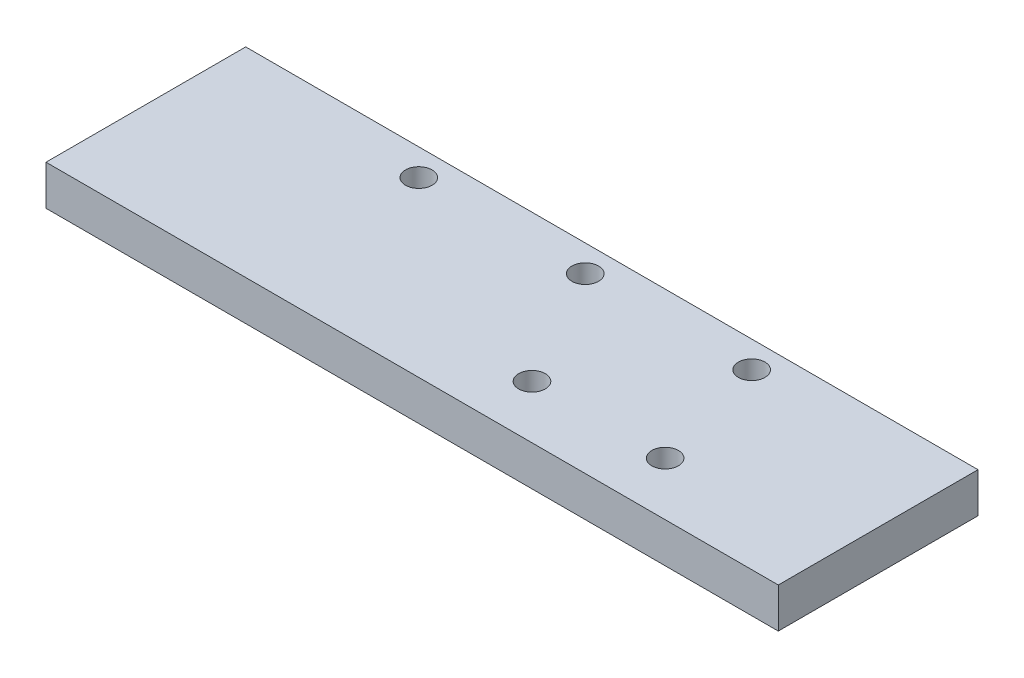
ISO-10303-21;
HEADER;
FILE_DESCRIPTION(('STEP AP214'),'2;1');
FILE_NAME('part.step','',(''),(''),'','','');
FILE_SCHEMA(('AUTOMOTIVE_DESIGN { 1 0 10303 214 1 1 1 1 }'));
ENDSEC;
DATA;
#1=APPLICATION_CONTEXT('core data for automotive mechanical design processes');
#2=APPLICATION_PROTOCOL_DEFINITION('international standard','automotive_design',2000,#1);
#3=PRODUCT_CONTEXT('',#1,'mechanical');
#4=PRODUCT('Part','Part','',(#3));
#5=PRODUCT_RELATED_PRODUCT_CATEGORY('part','',(#4));
#6=PRODUCT_DEFINITION_FORMATION('','',#4);
#7=PRODUCT_DEFINITION_CONTEXT('part definition',#1,'design');
#8=PRODUCT_DEFINITION('design','',#6,#7);
#9=PRODUCT_DEFINITION_SHAPE('','',#8);
#10=(LENGTH_UNIT() NAMED_UNIT(*) SI_UNIT(.MILLI.,.METRE.));
#11=(NAMED_UNIT(*) PLANE_ANGLE_UNIT() SI_UNIT($,.RADIAN.));
#12=(NAMED_UNIT(*) SI_UNIT($,.STERADIAN.) SOLID_ANGLE_UNIT());
#13=UNCERTAINTY_MEASURE_WITH_UNIT(LENGTH_MEASURE(1.E-05),#10,'distance_accuracy_value','');
#14=(GEOMETRIC_REPRESENTATION_CONTEXT(3) GLOBAL_UNCERTAINTY_ASSIGNED_CONTEXT((#13)) GLOBAL_UNIT_ASSIGNED_CONTEXT((#10,
#11,#12)) REPRESENTATION_CONTEXT('',''));
#15=CARTESIAN_POINT('',(0.,0.,0.));
#16=DIRECTION('',(0.,0.,1.));
#17=DIRECTION('',(1.,0.,0.));
#18=AXIS2_PLACEMENT_3D('',#15,#16,#17);
#19=CARTESIAN_POINT('',(-102.510460251046,6.,-65.1673640167364));
#20=DIRECTION('',(0.,0.,-1.));
#21=DIRECTION('',(-1.,0.,0.));
#22=AXIS2_PLACEMENT_3D('',#19,#20,#21);
#23=PLANE('',#22);
#24=DIRECTION('',(1.,0.,0.));
#25=VECTOR('',#24,1.);
#26=CARTESIAN_POINT('',(-102.510460251046,0.,-65.1673640167364));
#27=LINE('',#26,#25);
#28=CARTESIAN_POINT('',(-102.510460251046,0.,-65.1673640167364));
#29=VERTEX_POINT('',#28);
#30=CARTESIAN_POINT('',(7.48953974895393,0.,-65.1673640167364));
#31=VERTEX_POINT('',#30);
#32=EDGE_CURVE('E99',#29,#31,#27,.T.);
#33=ORIENTED_EDGE('',*,*,#32,.F.);
#34=DIRECTION('',(0.,-1.,0.));
#35=VECTOR('',#34,1.);
#36=CARTESIAN_POINT('',(-102.510460251046,6.,-65.1673640167364));
#37=LINE('',#36,#35);
#38=CARTESIAN_POINT('',(-102.510460251046,6.,-65.1673640167364));
#39=VERTEX_POINT('',#38);
#40=EDGE_CURVE('E11',#39,#29,#37,.T.);
#41=ORIENTED_EDGE('',*,*,#40,.F.);
#42=DIRECTION('',(1.,0.,0.));
#43=VECTOR('',#42,1.);
#44=CARTESIAN_POINT('',(-102.510460251046,6.,-65.1673640167364));
#45=LINE('',#44,#43);
#46=CARTESIAN_POINT('',(7.48953974895393,6.,-65.1673640167364));
#47=VERTEX_POINT('',#46);
#48=EDGE_CURVE('E93',#39,#47,#45,.T.);
#49=ORIENTED_EDGE('',*,*,#48,.T.);
#50=DIRECTION('',(0.,-1.,0.));
#51=VECTOR('',#50,1.);
#52=CARTESIAN_POINT('',(7.48953974895393,6.,-65.1673640167364));
#53=LINE('',#52,#51);
#54=EDGE_CURVE('E36',#47,#31,#53,.T.);
#55=ORIENTED_EDGE('',*,*,#54,.T.);
#56=EDGE_LOOP('',(#33,#41,#49,#55));
#57=FACE_BOUND('',#56,.T.);
#58=ADVANCED_FACE('F33',(#57),#23,.T.);
#59=CARTESIAN_POINT('',(-102.510460251046,6.,-65.1673640167364));
#60=DIRECTION('',(1.,0.,0.));
#61=DIRECTION('',(0.,0.,-1.));
#62=AXIS2_PLACEMENT_3D('',#59,#60,#61);
#63=PLANE('',#62);
#64=DIRECTION('',(0.,0.,1.));
#65=VECTOR('',#64,1.);
#66=CARTESIAN_POINT('',(-102.510460251046,0.,-65.1673640167364));
#67=LINE('',#66,#65);
#68=CARTESIAN_POINT('',(-102.510460251046,0.,-35.1673640167364));
#69=VERTEX_POINT('',#68);
#70=EDGE_CURVE('E66',#29,#69,#67,.T.);
#71=ORIENTED_EDGE('',*,*,#70,.T.);
#72=DIRECTION('',(0.,-1.,0.));
#73=VECTOR('',#72,1.);
#74=CARTESIAN_POINT('',(-102.510460251046,6.,-35.1673640167364));
#75=LINE('',#74,#73);
#76=CARTESIAN_POINT('',(-102.510460251046,6.,-35.1673640167364));
#77=VERTEX_POINT('',#76);
#78=EDGE_CURVE('E42',#77,#69,#75,.T.);
#79=ORIENTED_EDGE('',*,*,#78,.F.);
#80=DIRECTION('',(0.,0.,1.));
#81=VECTOR('',#80,1.);
#82=CARTESIAN_POINT('',(-102.510460251046,6.,-65.1673640167364));
#83=LINE('',#82,#81);
#84=EDGE_CURVE('E83',#39,#77,#83,.T.);
#85=ORIENTED_EDGE('',*,*,#84,.F.);
#86=ORIENTED_EDGE('',*,*,#40,.T.);
#87=EDGE_LOOP('',(#71,#79,#85,#86));
#88=FACE_BOUND('',#87,.T.);
#89=ADVANCED_FACE('F110',(#88),#63,.F.);
#90=CARTESIAN_POINT('',(-102.510460251046,6.,-35.1673640167364));
#91=DIRECTION('',(0.,0.,-1.));
#92=DIRECTION('',(-1.,0.,0.));
#93=AXIS2_PLACEMENT_3D('',#90,#91,#92);
#94=PLANE('',#93);
#95=DIRECTION('',(1.,0.,0.));
#96=VECTOR('',#95,1.);
#97=CARTESIAN_POINT('',(-102.510460251046,0.,-35.1673640167364));
#98=LINE('',#97,#96);
#99=CARTESIAN_POINT('',(7.48953974895393,0.,-35.1673640167364));
#100=VERTEX_POINT('',#99);
#101=EDGE_CURVE('E90',#69,#100,#98,.T.);
#102=ORIENTED_EDGE('',*,*,#101,.T.);
#103=DIRECTION('',(0.,-1.,0.));
#104=VECTOR('',#103,1.);
#105=CARTESIAN_POINT('',(7.48953974895393,6.,-35.1673640167364));
#106=LINE('',#105,#104);
#107=CARTESIAN_POINT('',(7.48953974895393,6.,-35.1673640167364));
#108=VERTEX_POINT('',#107);
#109=EDGE_CURVE('E87',#108,#100,#106,.T.);
#110=ORIENTED_EDGE('',*,*,#109,.F.);
#111=DIRECTION('',(1.,0.,0.));
#112=VECTOR('',#111,1.);
#113=CARTESIAN_POINT('',(-102.510460251046,6.,-35.1673640167364));
#114=LINE('',#113,#112);
#115=EDGE_CURVE('E78',#77,#108,#114,.T.);
#116=ORIENTED_EDGE('',*,*,#115,.F.);
#117=ORIENTED_EDGE('',*,*,#78,.T.);
#118=EDGE_LOOP('',(#102,#110,#116,#117));
#119=FACE_BOUND('',#118,.T.);
#120=ADVANCED_FACE('F88',(#119),#94,.F.);
#121=CARTESIAN_POINT('',(7.48953974895393,6.,-65.1673640167364));
#122=DIRECTION('',(1.,0.,0.));
#123=DIRECTION('',(0.,0.,-1.));
#124=AXIS2_PLACEMENT_3D('',#121,#122,#123);
#125=PLANE('',#124);
#126=DIRECTION('',(0.,0.,1.));
#127=VECTOR('',#126,1.);
#128=CARTESIAN_POINT('',(7.48953974895393,0.,-65.1673640167364));
#129=LINE('',#128,#127);
#130=EDGE_CURVE('E102',#31,#100,#129,.T.);
#131=ORIENTED_EDGE('',*,*,#130,.F.);
#132=ORIENTED_EDGE('',*,*,#54,.F.);
#133=DIRECTION('',(0.,0.,1.));
#134=VECTOR('',#133,1.);
#135=CARTESIAN_POINT('',(7.48953974895393,6.,-65.1673640167364));
#136=LINE('',#135,#134);
#137=EDGE_CURVE('E82',#47,#108,#136,.T.);
#138=ORIENTED_EDGE('',*,*,#137,.T.);
#139=ORIENTED_EDGE('',*,*,#109,.T.);
#140=EDGE_LOOP('',(#131,#132,#138,#139));
#141=FACE_BOUND('',#140,.T.);
#142=ADVANCED_FACE('F92',(#141),#125,.T.);
#143=CARTESIAN_POINT('',(0.,6.,0.));
#144=DIRECTION('',(0.,-1.,0.));
#145=DIRECTION('',(0.,0.,-1.));
#146=AXIS2_PLACEMENT_3D('',#143,#144,#145);
#147=PLANE('',#146);
#148=CARTESIAN_POINT('',(-72.5104602510461,6.,-61.1673640167364));
#149=DIRECTION('',(0.,-1.,0.));
#150=DIRECTION('',(0.,0.,-1.));
#151=AXIS2_PLACEMENT_3D('',#148,#149,#150);
#152=CIRCLE('',#151,2.);
#153=CARTESIAN_POINT('',(-72.5104602510461,6.,-63.1673640167364));
#154=VERTEX_POINT('',#153);
#155=EDGE_CURVE('E103',#154,#154,#152,.T.);
#156=ORIENTED_EDGE('',*,*,#155,.T.);
#157=EDGE_LOOP('',(#156));
#158=FACE_BOUND('',#157,.T.);
#159=CARTESIAN_POINT('',(-47.5104602510461,6.,-61.1673640167364));
#160=DIRECTION('',(0.,-1.,0.));
#161=DIRECTION('',(0.,0.,-1.));
#162=AXIS2_PLACEMENT_3D('',#159,#160,#161);
#163=CIRCLE('',#162,2.);
#164=CARTESIAN_POINT('',(-47.5104602510461,6.,-63.1673640167364));
#165=VERTEX_POINT('',#164);
#166=EDGE_CURVE('E159',#165,#165,#163,.T.);
#167=ORIENTED_EDGE('',*,*,#166,.T.);
#168=EDGE_LOOP('',(#167));
#169=FACE_BOUND('',#168,.T.);
#170=CARTESIAN_POINT('',(-22.5104602510461,6.,-61.1673640167364));
#171=DIRECTION('',(0.,-1.,0.));
#172=DIRECTION('',(0.,0.,-1.));
#173=AXIS2_PLACEMENT_3D('',#170,#171,#172);
#174=CIRCLE('',#173,2.00000000000001);
#175=CARTESIAN_POINT('',(-22.5104602510461,6.,-63.1673640167364));
#176=VERTEX_POINT('',#175);
#177=EDGE_CURVE('E161',#176,#176,#174,.T.);
#178=ORIENTED_EDGE('',*,*,#177,.T.);
#179=EDGE_LOOP('',(#178));
#180=FACE_BOUND('',#179,.T.);
#181=CARTESIAN_POINT('',(-17.5104602510461,6.,-43.1673640167364));
#182=DIRECTION('',(0.,-1.,0.));
#183=DIRECTION('',(0.,0.,-1.));
#184=AXIS2_PLACEMENT_3D('',#181,#182,#183);
#185=CIRCLE('',#184,2.);
#186=CARTESIAN_POINT('',(-17.5104602510461,6.,-45.1673640167364));
#187=VERTEX_POINT('',#186);
#188=EDGE_CURVE('E166',#187,#187,#185,.T.);
#189=ORIENTED_EDGE('',*,*,#188,.T.);
#190=EDGE_LOOP('',(#189));
#191=FACE_BOUND('',#190,.T.);
#192=CARTESIAN_POINT('',(-37.5104602510461,6.,-43.1673640167364));
#193=DIRECTION('',(0.,-1.,0.));
#194=DIRECTION('',(0.,0.,-1.));
#195=AXIS2_PLACEMENT_3D('',#192,#193,#194);
#196=CIRCLE('',#195,2.);
#197=CARTESIAN_POINT('',(-37.5104602510461,6.,-45.1673640167364));
#198=VERTEX_POINT('',#197);
#199=EDGE_CURVE('E169',#198,#198,#196,.T.);
#200=ORIENTED_EDGE('',*,*,#199,.T.);
#201=EDGE_LOOP('',(#200));
#202=FACE_BOUND('',#201,.T.);
#203=ORIENTED_EDGE('',*,*,#48,.F.);
#204=ORIENTED_EDGE('',*,*,#84,.T.);
#205=ORIENTED_EDGE('',*,*,#115,.T.);
#206=ORIENTED_EDGE('',*,*,#137,.F.);
#207=EDGE_LOOP('',(#203,#204,#205,#206));
#208=FACE_BOUND('',#207,.T.);
#209=ADVANCED_FACE('F81',(#158,#169,#180,#191,#202,#208),#147,.F.);
#210=CARTESIAN_POINT('',(0.,0.,0.));
#211=DIRECTION('',(0.,-1.,0.));
#212=DIRECTION('',(0.,0.,-1.));
#213=AXIS2_PLACEMENT_3D('',#210,#211,#212);
#214=PLANE('',#213);
#215=CARTESIAN_POINT('',(-72.5104602510461,0.,-61.1673640167364));
#216=DIRECTION('',(0.,-1.,0.));
#217=DIRECTION('',(0.,0.,-1.));
#218=AXIS2_PLACEMENT_3D('',#215,#216,#217);
#219=CIRCLE('',#218,2.);
#220=CARTESIAN_POINT('',(-72.5104602510461,0.,-63.1673640167364));
#221=VERTEX_POINT('',#220);
#222=EDGE_CURVE('E157',#221,#221,#219,.T.);
#223=ORIENTED_EDGE('',*,*,#222,.F.);
#224=EDGE_LOOP('',(#223));
#225=FACE_BOUND('',#224,.T.);
#226=CARTESIAN_POINT('',(-47.5104602510461,0.,-61.1673640167364));
#227=DIRECTION('',(0.,-1.,0.));
#228=DIRECTION('',(0.,0.,-1.));
#229=AXIS2_PLACEMENT_3D('',#226,#227,#228);
#230=CIRCLE('',#229,2.);
#231=CARTESIAN_POINT('',(-47.5104602510461,0.,-63.1673640167364));
#232=VERTEX_POINT('',#231);
#233=EDGE_CURVE('E181',#232,#232,#230,.T.);
#234=ORIENTED_EDGE('',*,*,#233,.F.);
#235=EDGE_LOOP('',(#234));
#236=FACE_BOUND('',#235,.T.);
#237=CARTESIAN_POINT('',(-22.5104602510461,0.,-61.1673640167364));
#238=DIRECTION('',(0.,-1.,0.));
#239=DIRECTION('',(0.,0.,-1.));
#240=AXIS2_PLACEMENT_3D('',#237,#238,#239);
#241=CIRCLE('',#240,2.00000000000001);
#242=CARTESIAN_POINT('',(-22.5104602510461,0.,-63.1673640167364));
#243=VERTEX_POINT('',#242);
#244=EDGE_CURVE('E178',#243,#243,#241,.T.);
#245=ORIENTED_EDGE('',*,*,#244,.F.);
#246=EDGE_LOOP('',(#245));
#247=FACE_BOUND('',#246,.T.);
#248=CARTESIAN_POINT('',(-17.5104602510461,0.,-43.1673640167364));
#249=DIRECTION('',(0.,-1.,0.));
#250=DIRECTION('',(0.,0.,-1.));
#251=AXIS2_PLACEMENT_3D('',#248,#249,#250);
#252=CIRCLE('',#251,2.);
#253=CARTESIAN_POINT('',(-17.5104602510461,0.,-45.1673640167364));
#254=VERTEX_POINT('',#253);
#255=EDGE_CURVE('E175',#254,#254,#252,.T.);
#256=ORIENTED_EDGE('',*,*,#255,.F.);
#257=EDGE_LOOP('',(#256));
#258=FACE_BOUND('',#257,.T.);
#259=CARTESIAN_POINT('',(-37.5104602510461,0.,-43.1673640167364));
#260=DIRECTION('',(0.,-1.,0.));
#261=DIRECTION('',(0.,0.,-1.));
#262=AXIS2_PLACEMENT_3D('',#259,#260,#261);
#263=CIRCLE('',#262,2.);
#264=CARTESIAN_POINT('',(-37.5104602510461,0.,-45.1673640167364));
#265=VERTEX_POINT('',#264);
#266=EDGE_CURVE('E172',#265,#265,#263,.T.);
#267=ORIENTED_EDGE('',*,*,#266,.F.);
#268=EDGE_LOOP('',(#267));
#269=FACE_BOUND('',#268,.T.);
#270=ORIENTED_EDGE('',*,*,#32,.T.);
#271=ORIENTED_EDGE('',*,*,#130,.T.);
#272=ORIENTED_EDGE('',*,*,#101,.F.);
#273=ORIENTED_EDGE('',*,*,#70,.F.);
#274=EDGE_LOOP('',(#270,#271,#272,#273));
#275=FACE_BOUND('',#274,.T.);
#276=ADVANCED_FACE('F108',(#225,#236,#247,#258,#269,#275),#214,.T.);
#277=CARTESIAN_POINT('',(-37.5104602510461,10.,-43.1673640167364));
#278=DIRECTION('',(0.,-1.,0.));
#279=DIRECTION('',(0.,0.,-1.));
#280=AXIS2_PLACEMENT_3D('',#277,#278,#279);
#281=CYLINDRICAL_SURFACE('',#280,2.);
#282=ORIENTED_EDGE('',*,*,#266,.T.);
#283=EDGE_LOOP('',(#282));
#284=FACE_BOUND('',#283,.T.);
#285=ORIENTED_EDGE('',*,*,#199,.F.);
#286=EDGE_LOOP('',(#285));
#287=FACE_BOUND('',#286,.T.);
#288=ADVANCED_FACE('F129',(#284,#287),#281,.F.);
#289=CARTESIAN_POINT('',(-17.5104602510461,10.,-43.1673640167364));
#290=DIRECTION('',(0.,-1.,0.));
#291=DIRECTION('',(0.,0.,-1.));
#292=AXIS2_PLACEMENT_3D('',#289,#290,#291);
#293=CYLINDRICAL_SURFACE('',#292,2.);
#294=ORIENTED_EDGE('',*,*,#255,.T.);
#295=EDGE_LOOP('',(#294));
#296=FACE_BOUND('',#295,.T.);
#297=ORIENTED_EDGE('',*,*,#188,.F.);
#298=EDGE_LOOP('',(#297));
#299=FACE_BOUND('',#298,.T.);
#300=ADVANCED_FACE('F136',(#296,#299),#293,.F.);
#301=CARTESIAN_POINT('',(-22.5104602510461,10.,-61.1673640167364));
#302=DIRECTION('',(0.,-1.,0.));
#303=DIRECTION('',(0.,0.,-1.));
#304=AXIS2_PLACEMENT_3D('',#301,#302,#303);
#305=CYLINDRICAL_SURFACE('',#304,2.00000000000001);
#306=ORIENTED_EDGE('',*,*,#244,.T.);
#307=EDGE_LOOP('',(#306));
#308=FACE_BOUND('',#307,.T.);
#309=ORIENTED_EDGE('',*,*,#177,.F.);
#310=EDGE_LOOP('',(#309));
#311=FACE_BOUND('',#310,.T.);
#312=ADVANCED_FACE('F140',(#308,#311),#305,.F.);
#313=CARTESIAN_POINT('',(-47.5104602510461,10.,-61.1673640167364));
#314=DIRECTION('',(0.,-1.,0.));
#315=DIRECTION('',(0.,0.,-1.));
#316=AXIS2_PLACEMENT_3D('',#313,#314,#315);
#317=CYLINDRICAL_SURFACE('',#316,2.);
#318=ORIENTED_EDGE('',*,*,#233,.T.);
#319=EDGE_LOOP('',(#318));
#320=FACE_BOUND('',#319,.T.);
#321=ORIENTED_EDGE('',*,*,#166,.F.);
#322=EDGE_LOOP('',(#321));
#323=FACE_BOUND('',#322,.T.);
#324=ADVANCED_FACE('F144',(#320,#323),#317,.F.);
#325=CARTESIAN_POINT('',(-72.5104602510461,10.,-61.1673640167364));
#326=DIRECTION('',(0.,-1.,0.));
#327=DIRECTION('',(0.,0.,-1.));
#328=AXIS2_PLACEMENT_3D('',#325,#326,#327);
#329=CYLINDRICAL_SURFACE('',#328,2.);
#330=ORIENTED_EDGE('',*,*,#222,.T.);
#331=EDGE_LOOP('',(#330));
#332=FACE_BOUND('',#331,.T.);
#333=ORIENTED_EDGE('',*,*,#155,.F.);
#334=EDGE_LOOP('',(#333));
#335=FACE_BOUND('',#334,.T.);
#336=ADVANCED_FACE('F148',(#332,#335),#329,.F.);
#337=CLOSED_SHELL('',(#58,#89,#120,#142,#209,#276,#288,#300,#312,#324,#336));
#338=MANIFOLD_SOLID_BREP('B2',#337);
#339=ADVANCED_BREP_SHAPE_REPRESENTATION('',(#18,#338),#14);
#340=SHAPE_DEFINITION_REPRESENTATION(#9,#339);
ENDSEC;
END-ISO-10303-21;
